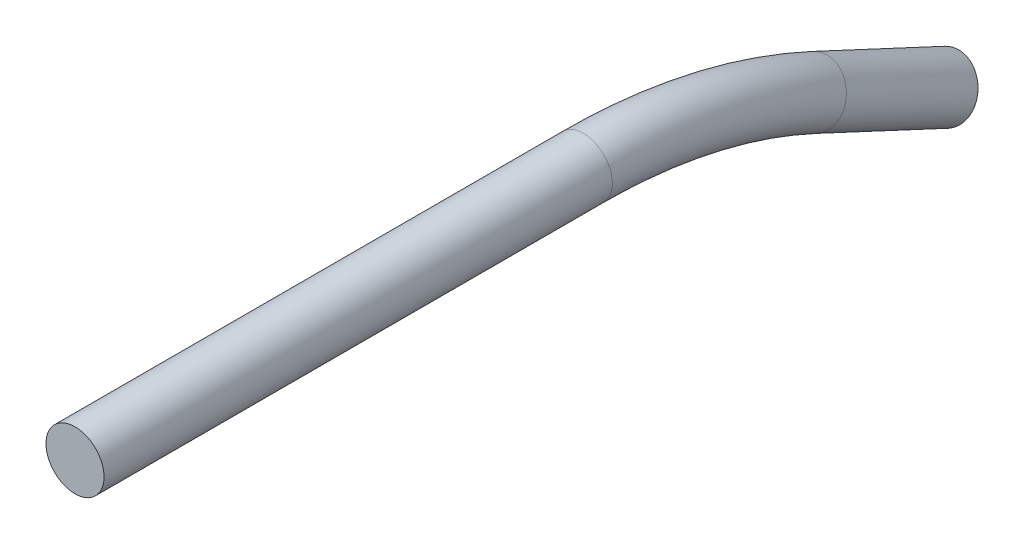
ISO-10303-21;
HEADER;
FILE_DESCRIPTION(('STEP AP214'),'2;1');
FILE_NAME('part.step','',(''),(''),'','','');
FILE_SCHEMA(('AUTOMOTIVE_DESIGN { 1 0 10303 214 1 1 1 1 }'));
ENDSEC;
DATA;
#1=APPLICATION_CONTEXT('core data for automotive mechanical design processes');
#2=APPLICATION_PROTOCOL_DEFINITION('international standard','automotive_design',2000,#1);
#3=PRODUCT_CONTEXT('',#1,'mechanical');
#4=PRODUCT('Part','Part','',(#3));
#5=PRODUCT_RELATED_PRODUCT_CATEGORY('part','',(#4));
#6=PRODUCT_DEFINITION_FORMATION('','',#4);
#7=PRODUCT_DEFINITION_CONTEXT('part definition',#1,'design');
#8=PRODUCT_DEFINITION('design','',#6,#7);
#9=PRODUCT_DEFINITION_SHAPE('','',#8);
#10=(LENGTH_UNIT() NAMED_UNIT(*) SI_UNIT(.MILLI.,.METRE.));
#11=(NAMED_UNIT(*) PLANE_ANGLE_UNIT() SI_UNIT($,.RADIAN.));
#12=(NAMED_UNIT(*) SI_UNIT($,.STERADIAN.) SOLID_ANGLE_UNIT());
#13=UNCERTAINTY_MEASURE_WITH_UNIT(LENGTH_MEASURE(1.E-05),#10,'distance_accuracy_value','');
#14=(GEOMETRIC_REPRESENTATION_CONTEXT(3) GLOBAL_UNCERTAINTY_ASSIGNED_CONTEXT((#13)) GLOBAL_UNIT_ASSIGNED_CONTEXT((#10,
#11,#12)) REPRESENTATION_CONTEXT('',''));
#15=CARTESIAN_POINT('',(0.,0.,0.));
#16=DIRECTION('',(0.,0.,1.));
#17=DIRECTION('',(1.,0.,0.));
#18=AXIS2_PLACEMENT_3D('',#15,#16,#17);
#19=CARTESIAN_POINT('',(8.326,-3.999,-6.02));
#20=DIRECTION('',(0.,0.,1.));
#21=DIRECTION('',(-1.,0.,0.));
#22=AXIS2_PLACEMENT_3D('',#19,#20,#21);
#23=PLANE('',#22);
#24=CARTESIAN_POINT('',(8.125,-4.2,-6.02));
#25=DIRECTION('',(0.,0.,1.));
#26=DIRECTION('',(1.,0.,0.));
#27=AXIS2_PLACEMENT_3D('',#24,#25,#26);
#28=CIRCLE('',#27,0.2);
#29=CARTESIAN_POINT('',(8.325,-4.2,-6.02));
#30=VERTEX_POINT('',#29);
#31=EDGE_CURVE('E31',#30,#30,#28,.F.);
#32=ORIENTED_EDGE('',*,*,#31,.F.);
#33=EDGE_LOOP('',(#32));
#34=FACE_BOUND('',#33,.T.);
#35=ADVANCED_FACE('F15',(#34),#23,.T.);
#36=CARTESIAN_POINT('',(8.125,-4.2,-9.52));
#37=DIRECTION('',(0.,0.,1.));
#38=DIRECTION('',(1.,0.,0.));
#39=AXIS2_PLACEMENT_3D('',#36,#37,#38);
#40=CYLINDRICAL_SURFACE('',#39,0.2);
#41=ORIENTED_EDGE('',*,*,#31,.T.);
#42=EDGE_LOOP('',(#41));
#43=FACE_BOUND('',#42,.T.);
#44=CARTESIAN_POINT('',(8.125,-4.2,-9.52));
#45=DIRECTION('',(0.,0.,-1.));
#46=DIRECTION('',(-1.,0.,0.));
#47=AXIS2_PLACEMENT_3D('',#44,#45,#46);
#48=CIRCLE('',#47,0.2);
#49=CARTESIAN_POINT('',(7.925,-4.2,-9.52));
#50=VERTEX_POINT('',#49);
#51=EDGE_CURVE('E28',#50,#50,#48,.T.);
#52=ORIENTED_EDGE('',*,*,#51,.F.);
#53=EDGE_LOOP('',(#52));
#54=FACE_BOUND('',#53,.T.);
#55=ADVANCED_FACE('F38',(#43,#54),#40,.T.);
#56=CARTESIAN_POINT('',(7.924,-4.79376345405194,-12.104946270602));
#57=DIRECTION('',(0.,-0.422618261741009,-0.906307787036506));
#58=DIRECTION('',(1.,0.,0.));
#59=AXIS2_PLACEMENT_3D('',#56,#57,#58);
#60=PLANE('',#59);
#61=CARTESIAN_POINT('',(8.125,-4.97593131923963,-12.0199999999952));
#62=DIRECTION('',(0.,0.422618261740962,0.906307787036527));
#63=DIRECTION('',(0.,-0.906307787036527,0.422618261740962));
#64=AXIS2_PLACEMENT_3D('',#61,#62,#63);
#65=CIRCLE('',#64,0.200000000000008);
#66=CARTESIAN_POINT('',(8.125,-5.15719287664694,-11.935476347647));
#67=VERTEX_POINT('',#66);
#68=EDGE_CURVE('E23',#67,#67,#65,.T.);
#69=ORIENTED_EDGE('',*,*,#68,.F.);
#70=EDGE_LOOP('',(#69));
#71=FACE_BOUND('',#70,.T.);
#72=ADVANCED_FACE('F40',(#71),#60,.T.);
#73=CARTESIAN_POINT('',(8.12500000000004,-7.97099703729429,-9.52000000001683));
#74=DIRECTION('',(1.,0.,0.));
#75=DIRECTION('',(0.,1.,0.));
#76=AXIS2_PLACEMENT_3D('',#73,#74,#75);
#77=TOROIDAL_SURFACE('',#76,3.77099703729429,0.200000000000008);
#78=CARTESIAN_POINT('',(8.125,-4.55331305751668,-11.1136922129969));
#79=DIRECTION('',(0.,-0.422618261740942,-0.906307787036537));
#80=DIRECTION('',(0.,0.906307787036537,-0.422618261740942));
#81=AXIS2_PLACEMENT_3D('',#78,#79,#80);
#82=CIRCLE('',#81,0.200000000000007);
#83=CARTESIAN_POINT('',(8.125,-4.37205150010937,-11.1982158653451));
#84=VERTEX_POINT('',#83);
#85=EDGE_CURVE('E10',#84,#84,#82,.T.);
#86=ORIENTED_EDGE('',*,*,#85,.F.);
#87=EDGE_LOOP('',(#86));
#88=FACE_BOUND('',#87,.T.);
#89=ORIENTED_EDGE('',*,*,#51,.T.);
#90=EDGE_LOOP('',(#89));
#91=FACE_BOUND('',#90,.T.);
#92=ADVANCED_FACE('F36',(#88,#91),#77,.T.);
#93=CARTESIAN_POINT('',(8.125,-4.97593131924333,-12.0200000000031));
#94=DIRECTION('',(0.,0.422618261740962,0.906307787036527));
#95=DIRECTION('',(0.,-0.906307787036527,0.422618261740962));
#96=AXIS2_PLACEMENT_3D('',#93,#94,#95);
#97=CYLINDRICAL_SURFACE('',#96,0.200000000000008);
#98=ORIENTED_EDGE('',*,*,#85,.T.);
#99=EDGE_LOOP('',(#98));
#100=FACE_BOUND('',#99,.T.);
#101=ORIENTED_EDGE('',*,*,#68,.T.);
#102=EDGE_LOOP('',(#101));
#103=FACE_BOUND('',#102,.T.);
#104=ADVANCED_FACE('F17',(#100,#103),#97,.T.);
#105=CLOSED_SHELL('',(#35,#55,#72,#92,#104));
#106=MANIFOLD_SOLID_BREP('B1',#105);
#107=ADVANCED_BREP_SHAPE_REPRESENTATION('',(#18,#106),#14);
#108=SHAPE_DEFINITION_REPRESENTATION(#9,#107);
ENDSEC;
END-ISO-10303-21;
